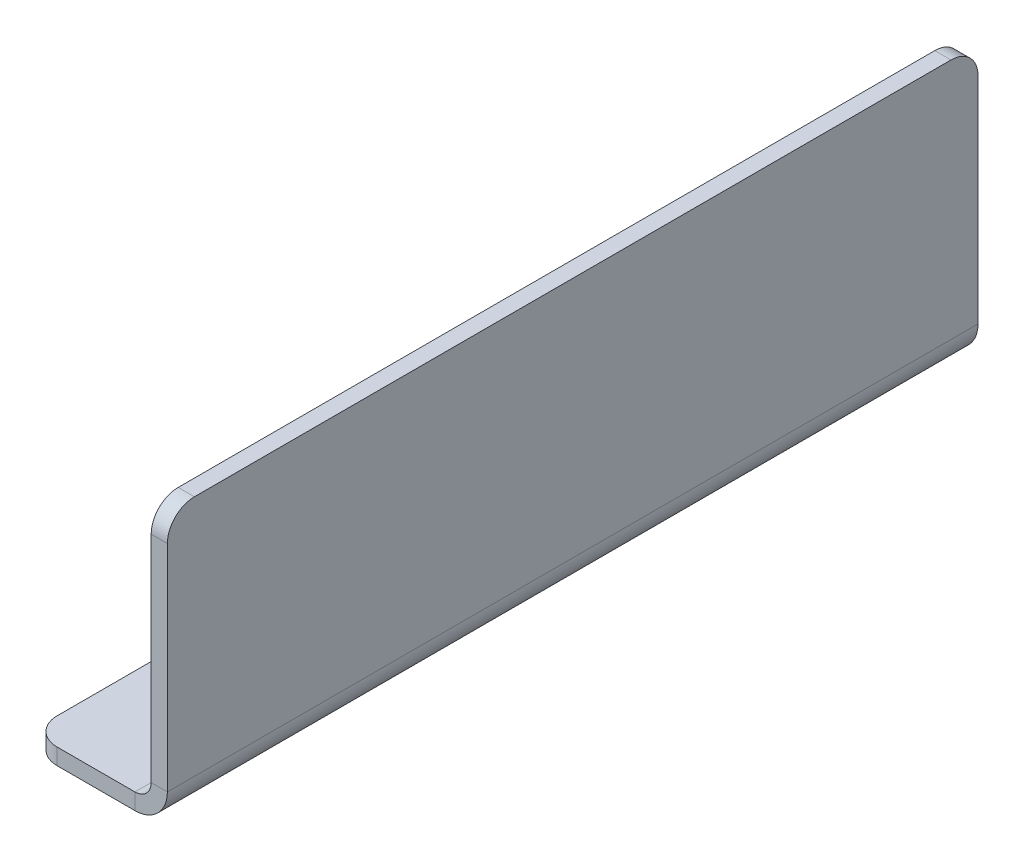
ISO-10303-21;
HEADER;
FILE_DESCRIPTION(('STEP AP214'),'2;1');
FILE_NAME('part.step','',(''),(''),'','','');
FILE_SCHEMA(('AUTOMOTIVE_DESIGN { 1 0 10303 214 1 1 1 1 }'));
ENDSEC;
DATA;
#1=APPLICATION_CONTEXT('core data for automotive mechanical design processes');
#2=APPLICATION_PROTOCOL_DEFINITION('international standard','automotive_design',2000,#1);
#3=PRODUCT_CONTEXT('',#1,'mechanical');
#4=PRODUCT('Part','Part','',(#3));
#5=PRODUCT_RELATED_PRODUCT_CATEGORY('part','',(#4));
#6=PRODUCT_DEFINITION_FORMATION('','',#4);
#7=PRODUCT_DEFINITION_CONTEXT('part definition',#1,'design');
#8=PRODUCT_DEFINITION('design','',#6,#7);
#9=PRODUCT_DEFINITION_SHAPE('','',#8);
#10=(LENGTH_UNIT() NAMED_UNIT(*) SI_UNIT(.MILLI.,.METRE.));
#11=(NAMED_UNIT(*) PLANE_ANGLE_UNIT() SI_UNIT($,.RADIAN.));
#12=(NAMED_UNIT(*) SI_UNIT($,.STERADIAN.) SOLID_ANGLE_UNIT());
#13=UNCERTAINTY_MEASURE_WITH_UNIT(LENGTH_MEASURE(1.E-05),#10,'distance_accuracy_value','');
#14=(GEOMETRIC_REPRESENTATION_CONTEXT(3) GLOBAL_UNCERTAINTY_ASSIGNED_CONTEXT((#13)) GLOBAL_UNIT_ASSIGNED_CONTEXT((#10,
#11,#12)) REPRESENTATION_CONTEXT('',''));
#15=CARTESIAN_POINT('',(0.,0.,0.));
#16=DIRECTION('',(0.,0.,1.));
#17=DIRECTION('',(1.,0.,0.));
#18=AXIS2_PLACEMENT_3D('',#15,#16,#17);
#19=CARTESIAN_POINT('',(-6.,0.,150.));
#20=DIRECTION('',(0.,0.,1.));
#21=DIRECTION('',(1.,0.,0.));
#22=AXIS2_PLACEMENT_3D('',#19,#20,#21);
#23=PLANE('',#22);
#24=DIRECTION('',(0.,1.,0.));
#25=VECTOR('',#24,1.);
#26=CARTESIAN_POINT('',(-6.,0.,150.));
#27=LINE('',#26,#25);
#28=CARTESIAN_POINT('',(-6.,0.,150.));
#29=VERTEX_POINT('',#28);
#30=CARTESIAN_POINT('',(-6.,3.,150.));
#31=VERTEX_POINT('',#30);
#32=EDGE_CURVE('E136',#29,#31,#27,.T.);
#33=ORIENTED_EDGE('',*,*,#32,.F.);
#34=CARTESIAN_POINT('',(-6.,6.,150.));
#35=DIRECTION('',(0.,0.,1.));
#36=DIRECTION('',(1.,0.,0.));
#37=AXIS2_PLACEMENT_3D('',#34,#35,#36);
#38=CIRCLE('',#37,6.);
#39=CARTESIAN_POINT('',(0.,6.,150.));
#40=VERTEX_POINT('',#39);
#41=EDGE_CURVE('E140',#40,#29,#38,.F.);
#42=ORIENTED_EDGE('',*,*,#41,.F.);
#43=DIRECTION('',(1.,0.,0.));
#44=VECTOR('',#43,1.);
#45=CARTESIAN_POINT('',(-3.,6.,150.));
#46=LINE('',#45,#44);
#47=CARTESIAN_POINT('',(-3.,6.,150.));
#48=VERTEX_POINT('',#47);
#49=EDGE_CURVE('E149',#48,#40,#46,.T.);
#50=ORIENTED_EDGE('',*,*,#49,.F.);
#51=CARTESIAN_POINT('',(-6.,6.,150.));
#52=DIRECTION('',(0.,0.,1.));
#53=DIRECTION('',(1.,0.,0.));
#54=AXIS2_PLACEMENT_3D('',#51,#52,#53);
#55=CIRCLE('',#54,3.);
#56=EDGE_CURVE('E142',#48,#31,#55,.F.);
#57=ORIENTED_EDGE('',*,*,#56,.T.);
#58=EDGE_LOOP('',(#33,#42,#50,#57));
#59=FACE_BOUND('',#58,.T.);
#60=ADVANCED_FACE('F45',(#59),#23,.T.);
#61=CARTESIAN_POINT('',(-3.,6.,150.));
#62=DIRECTION('',(0.,0.,1.));
#63=DIRECTION('',(1.,0.,0.));
#64=AXIS2_PLACEMENT_3D('',#61,#62,#63);
#65=PLANE('',#64);
#66=DIRECTION('',(-1.,0.,0.));
#67=VECTOR('',#66,1.);
#68=CARTESIAN_POINT('',(0.,3.,150.));
#69=LINE('',#68,#67);
#70=CARTESIAN_POINT('',(-20.4,3.,150.));
#71=VERTEX_POINT('',#70);
#72=EDGE_CURVE('E172',#31,#71,#69,.T.);
#73=ORIENTED_EDGE('',*,*,#72,.T.);
#74=DIRECTION('',(0.,1.,0.));
#75=VECTOR('',#74,1.);
#76=CARTESIAN_POINT('',(-20.4,6.,150.));
#77=LINE('',#76,#75);
#78=CARTESIAN_POINT('',(-20.4,0.,150.));
#79=VERTEX_POINT('',#78);
#80=EDGE_CURVE('E11',#71,#79,#77,.F.);
#81=ORIENTED_EDGE('',*,*,#80,.T.);
#82=DIRECTION('',(-1.,0.,0.));
#83=VECTOR('',#82,1.);
#84=CARTESIAN_POINT('',(0.,0.,150.));
#85=LINE('',#84,#83);
#86=EDGE_CURVE('E158',#29,#79,#85,.T.);
#87=ORIENTED_EDGE('',*,*,#86,.F.);
#88=ORIENTED_EDGE('',*,*,#32,.T.);
#89=EDGE_LOOP('',(#73,#81,#87,#88));
#90=FACE_BOUND('',#89,.T.);
#91=ADVANCED_FACE('F169',(#90),#65,.T.);
#92=CARTESIAN_POINT('',(0.,6.,0.));
#93=DIRECTION('',(0.,0.,-1.));
#94=DIRECTION('',(-1.,0.,0.));
#95=AXIS2_PLACEMENT_3D('',#92,#93,#94);
#96=PLANE('',#95);
#97=DIRECTION('',(-1.,0.,0.));
#98=VECTOR('',#97,1.);
#99=CARTESIAN_POINT('',(0.,6.,0.));
#100=LINE('',#99,#98);
#101=CARTESIAN_POINT('',(0.,6.,0.));
#102=VERTEX_POINT('',#101);
#103=CARTESIAN_POINT('',(-3.,6.,0.));
#104=VERTEX_POINT('',#103);
#105=EDGE_CURVE('E234',#102,#104,#100,.T.);
#106=ORIENTED_EDGE('',*,*,#105,.F.);
#107=CARTESIAN_POINT('',(-6.,6.,0.));
#108=DIRECTION('',(0.,0.,1.));
#109=DIRECTION('',(1.,0.,0.));
#110=AXIS2_PLACEMENT_3D('',#107,#108,#109);
#111=CIRCLE('',#110,6.);
#112=CARTESIAN_POINT('',(-6.,0.,0.));
#113=VERTEX_POINT('',#112);
#114=EDGE_CURVE('E197',#102,#113,#111,.F.);
#115=ORIENTED_EDGE('',*,*,#114,.T.);
#116=DIRECTION('',(0.,-1.,0.));
#117=VECTOR('',#116,1.);
#118=CARTESIAN_POINT('',(-6.,3.,0.));
#119=LINE('',#118,#117);
#120=CARTESIAN_POINT('',(-6.,3.,0.));
#121=VERTEX_POINT('',#120);
#122=EDGE_CURVE('E231',#121,#113,#119,.T.);
#123=ORIENTED_EDGE('',*,*,#122,.F.);
#124=CARTESIAN_POINT('',(-6.,6.,0.));
#125=DIRECTION('',(0.,0.,1.));
#126=DIRECTION('',(1.,0.,0.));
#127=AXIS2_PLACEMENT_3D('',#124,#125,#126);
#128=CIRCLE('',#127,3.);
#129=EDGE_CURVE('E206',#104,#121,#128,.F.);
#130=ORIENTED_EDGE('',*,*,#129,.F.);
#131=EDGE_LOOP('',(#106,#115,#123,#130));
#132=FACE_BOUND('',#131,.T.);
#133=ADVANCED_FACE('F371',(#132),#96,.T.);
#134=CARTESIAN_POINT('',(-6.,3.,0.));
#135=DIRECTION('',(0.,0.,-1.));
#136=DIRECTION('',(-1.,0.,0.));
#137=AXIS2_PLACEMENT_3D('',#134,#135,#136);
#138=PLANE('',#137);
#139=DIRECTION('',(0.,1.,0.));
#140=VECTOR('',#139,1.);
#141=CARTESIAN_POINT('',(-3.,0.,0.));
#142=LINE('',#141,#140);
#143=CARTESIAN_POINT('',(-3.,45.8,0.));
#144=VERTEX_POINT('',#143);
#145=EDGE_CURVE('E203',#144,#104,#142,.F.);
#146=ORIENTED_EDGE('',*,*,#145,.F.);
#147=DIRECTION('',(1.,0.,0.));
#148=VECTOR('',#147,1.);
#149=CARTESIAN_POINT('',(-6.,45.8,0.));
#150=LINE('',#149,#148);
#151=CARTESIAN_POINT('',(0.,45.8,0.));
#152=VERTEX_POINT('',#151);
#153=EDGE_CURVE('E263',#144,#152,#150,.T.);
#154=ORIENTED_EDGE('',*,*,#153,.T.);
#155=DIRECTION('',(0.,-1.,0.));
#156=VECTOR('',#155,1.);
#157=CARTESIAN_POINT('',(0.,0.,0.));
#158=LINE('',#157,#156);
#159=EDGE_CURVE('E200',#152,#102,#158,.T.);
#160=ORIENTED_EDGE('',*,*,#159,.T.);
#161=ORIENTED_EDGE('',*,*,#105,.T.);
#162=EDGE_LOOP('',(#146,#154,#160,#161));
#163=FACE_BOUND('',#162,.T.);
#164=ADVANCED_FACE('F293',(#163),#138,.T.);
#165=CARTESIAN_POINT('',(0.,3.,150.));
#166=DIRECTION('',(0.,-1.,0.));
#167=DIRECTION('',(1.,0.,0.));
#168=AXIS2_PLACEMENT_3D('',#165,#166,#167);
#169=PLANE('',#168);
#170=CARTESIAN_POINT('',(-15.7,3.,25.));
#171=DIRECTION('',(0.,1.,0.));
#172=DIRECTION('',(0.,0.,1.));
#173=AXIS2_PLACEMENT_3D('',#170,#171,#172);
#174=CIRCLE('',#173,1.63194999999999);
#175=CARTESIAN_POINT('',(-15.7,3.,26.63195));
#176=VERTEX_POINT('',#175);
#177=EDGE_CURVE('E335',#176,#176,#174,.T.);
#178=ORIENTED_EDGE('',*,*,#177,.F.);
#179=EDGE_LOOP('',(#178));
#180=FACE_BOUND('',#179,.T.);
#181=CARTESIAN_POINT('',(-15.7,3.,75.));
#182=DIRECTION('',(0.,1.,0.));
#183=DIRECTION('',(0.,0.,1.));
#184=AXIS2_PLACEMENT_3D('',#181,#182,#183);
#185=CIRCLE('',#184,1.63194999999999);
#186=CARTESIAN_POINT('',(-15.7,3.,76.63195));
#187=VERTEX_POINT('',#186);
#188=EDGE_CURVE('E327',#187,#187,#185,.T.);
#189=ORIENTED_EDGE('',*,*,#188,.F.);
#190=EDGE_LOOP('',(#189));
#191=FACE_BOUND('',#190,.T.);
#192=CARTESIAN_POINT('',(-15.7,3.,125.));
#193=DIRECTION('',(0.,1.,0.));
#194=DIRECTION('',(0.,0.,1.));
#195=AXIS2_PLACEMENT_3D('',#192,#193,#194);
#196=CIRCLE('',#195,1.63194999999999);
#197=CARTESIAN_POINT('',(-15.7,3.,126.63195));
#198=VERTEX_POINT('',#197);
#199=EDGE_CURVE('E319',#198,#198,#196,.T.);
#200=ORIENTED_EDGE('',*,*,#199,.F.);
#201=EDGE_LOOP('',(#200));
#202=FACE_BOUND('',#201,.T.);
#203=DIRECTION('',(-1.,0.,0.));
#204=VECTOR('',#203,1.);
#205=CARTESIAN_POINT('',(0.,3.,0.));
#206=LINE('',#205,#204);
#207=CARTESIAN_POINT('',(-20.4,3.,0.));
#208=VERTEX_POINT('',#207);
#209=EDGE_CURVE('E190',#121,#208,#206,.T.);
#210=ORIENTED_EDGE('',*,*,#209,.T.);
#211=CARTESIAN_POINT('',(-20.4,3.,5.));
#212=DIRECTION('',(0.,-1.,0.));
#213=DIRECTION('',(1.,0.,0.));
#214=AXIS2_PLACEMENT_3D('',#211,#212,#213);
#215=CIRCLE('',#214,5.);
#216=CARTESIAN_POINT('',(-25.4,3.,5.));
#217=VERTEX_POINT('',#216);
#218=EDGE_CURVE('E247',#208,#217,#215,.F.);
#219=ORIENTED_EDGE('',*,*,#218,.T.);
#220=DIRECTION('',(0.,0.,-1.));
#221=VECTOR('',#220,1.);
#222=CARTESIAN_POINT('',(-25.4,3.,150.));
#223=LINE('',#222,#221);
#224=CARTESIAN_POINT('',(-25.4,3.,145.));
#225=VERTEX_POINT('',#224);
#226=EDGE_CURVE('E227',#225,#217,#223,.T.);
#227=ORIENTED_EDGE('',*,*,#226,.F.);
#228=CARTESIAN_POINT('',(-20.4,3.,145.));
#229=DIRECTION('',(0.,-1.,0.));
#230=DIRECTION('',(1.,0.,0.));
#231=AXIS2_PLACEMENT_3D('',#228,#229,#230);
#232=CIRCLE('',#231,5.);
#233=EDGE_CURVE('E244',#225,#71,#232,.F.);
#234=ORIENTED_EDGE('',*,*,#233,.T.);
#235=ORIENTED_EDGE('',*,*,#72,.F.);
#236=DIRECTION('',(0.,0.,-1.));
#237=VECTOR('',#236,1.);
#238=CARTESIAN_POINT('',(-6.,3.,150.));
#239=LINE('',#238,#237);
#240=EDGE_CURVE('E189',#31,#121,#239,.T.);
#241=ORIENTED_EDGE('',*,*,#240,.T.);
#242=EDGE_LOOP('',(#210,#219,#227,#234,#235,#241));
#243=FACE_BOUND('',#242,.T.);
#244=ADVANCED_FACE('F312',(#180,#191,#202,#243),#169,.F.);
#245=CARTESIAN_POINT('',(-25.4,0.,150.));
#246=DIRECTION('',(-1.,0.,0.));
#247=DIRECTION('',(0.,0.,1.));
#248=AXIS2_PLACEMENT_3D('',#245,#246,#247);
#249=PLANE('',#248);
#250=ORIENTED_EDGE('',*,*,#226,.T.);
#251=DIRECTION('',(0.,1.,0.));
#252=VECTOR('',#251,1.);
#253=CARTESIAN_POINT('',(-25.4,0.,5.));
#254=LINE('',#253,#252);
#255=CARTESIAN_POINT('',(-25.4,0.,5.));
#256=VERTEX_POINT('',#255);
#257=EDGE_CURVE('E254',#217,#256,#254,.F.);
#258=ORIENTED_EDGE('',*,*,#257,.T.);
#259=DIRECTION('',(0.,0.,-1.));
#260=VECTOR('',#259,1.);
#261=CARTESIAN_POINT('',(-25.4,0.,150.));
#262=LINE('',#261,#260);
#263=CARTESIAN_POINT('',(-25.4,0.,145.));
#264=VERTEX_POINT('',#263);
#265=EDGE_CURVE('E166',#264,#256,#262,.T.);
#266=ORIENTED_EDGE('',*,*,#265,.F.);
#267=DIRECTION('',(0.,1.,0.));
#268=VECTOR('',#267,1.);
#269=CARTESIAN_POINT('',(-25.4,0.,145.));
#270=LINE('',#269,#268);
#271=EDGE_CURVE('E250',#264,#225,#270,.T.);
#272=ORIENTED_EDGE('',*,*,#271,.T.);
#273=EDGE_LOOP('',(#250,#258,#266,#272));
#274=FACE_BOUND('',#273,.T.);
#275=ADVANCED_FACE('F344',(#274),#249,.T.);
#276=CARTESIAN_POINT('',(0.,0.,150.));
#277=DIRECTION('',(0.,-1.,0.));
#278=DIRECTION('',(1.,0.,0.));
#279=AXIS2_PLACEMENT_3D('',#276,#277,#278);
#280=PLANE('',#279);
#281=CARTESIAN_POINT('',(-15.7,0.,25.));
#282=DIRECTION('',(0.,1.,0.));
#283=DIRECTION('',(0.,0.,1.));
#284=AXIS2_PLACEMENT_3D('',#281,#282,#283);
#285=CIRCLE('',#284,1.63195);
#286=CARTESIAN_POINT('',(-15.7,0.,26.63195));
#287=VERTEX_POINT('',#286);
#288=EDGE_CURVE('E331',#287,#287,#285,.T.);
#289=ORIENTED_EDGE('',*,*,#288,.T.);
#290=EDGE_LOOP('',(#289));
#291=FACE_BOUND('',#290,.T.);
#292=CARTESIAN_POINT('',(-15.7,0.,75.));
#293=DIRECTION('',(0.,1.,0.));
#294=DIRECTION('',(0.,0.,1.));
#295=AXIS2_PLACEMENT_3D('',#292,#293,#294);
#296=CIRCLE('',#295,1.63195);
#297=CARTESIAN_POINT('',(-15.7,0.,76.63195));
#298=VERTEX_POINT('',#297);
#299=EDGE_CURVE('E323',#298,#298,#296,.T.);
#300=ORIENTED_EDGE('',*,*,#299,.T.);
#301=EDGE_LOOP('',(#300));
#302=FACE_BOUND('',#301,.T.);
#303=CARTESIAN_POINT('',(-15.7,0.,125.));
#304=DIRECTION('',(0.,1.,0.));
#305=DIRECTION('',(0.,0.,1.));
#306=AXIS2_PLACEMENT_3D('',#303,#304,#305);
#307=CIRCLE('',#306,1.63195);
#308=CARTESIAN_POINT('',(-15.7,0.,126.63195));
#309=VERTEX_POINT('',#308);
#310=EDGE_CURVE('E194',#309,#309,#307,.T.);
#311=ORIENTED_EDGE('',*,*,#310,.T.);
#312=EDGE_LOOP('',(#311));
#313=FACE_BOUND('',#312,.T.);
#314=ORIENTED_EDGE('',*,*,#265,.T.);
#315=CARTESIAN_POINT('',(-20.4,0.,5.));
#316=DIRECTION('',(0.,-1.,0.));
#317=DIRECTION('',(1.,0.,0.));
#318=AXIS2_PLACEMENT_3D('',#315,#316,#317);
#319=CIRCLE('',#318,5.);
#320=CARTESIAN_POINT('',(-20.4,0.,0.));
#321=VERTEX_POINT('',#320);
#322=EDGE_CURVE('E260',#256,#321,#319,.T.);
#323=ORIENTED_EDGE('',*,*,#322,.T.);
#324=DIRECTION('',(-1.,0.,0.));
#325=VECTOR('',#324,1.);
#326=CARTESIAN_POINT('',(0.,0.,0.));
#327=LINE('',#326,#325);
#328=EDGE_CURVE('E161',#113,#321,#327,.T.);
#329=ORIENTED_EDGE('',*,*,#328,.F.);
#330=DIRECTION('',(0.,0.,-1.));
#331=VECTOR('',#330,1.);
#332=CARTESIAN_POINT('',(-6.,0.,150.));
#333=LINE('',#332,#331);
#334=EDGE_CURVE('E155',#29,#113,#333,.T.);
#335=ORIENTED_EDGE('',*,*,#334,.F.);
#336=ORIENTED_EDGE('',*,*,#86,.T.);
#337=CARTESIAN_POINT('',(-20.4,0.,145.));
#338=DIRECTION('',(0.,-1.,0.));
#339=DIRECTION('',(1.,0.,0.));
#340=AXIS2_PLACEMENT_3D('',#337,#338,#339);
#341=CIRCLE('',#340,5.);
#342=EDGE_CURVE('E257',#79,#264,#341,.T.);
#343=ORIENTED_EDGE('',*,*,#342,.T.);
#344=EDGE_LOOP('',(#314,#323,#329,#335,#336,#343));
#345=FACE_BOUND('',#344,.T.);
#346=ADVANCED_FACE('F157',(#291,#302,#313,#345),#280,.T.);
#347=CARTESIAN_POINT('',(-6.,6.,150.));
#348=DIRECTION('',(0.,0.,-1.));
#349=DIRECTION('',(-1.,0.,0.));
#350=AXIS2_PLACEMENT_3D('',#347,#348,#349);
#351=CYLINDRICAL_SURFACE('',#350,6.);
#352=ORIENTED_EDGE('',*,*,#114,.F.);
#353=DIRECTION('',(0.,0.,-1.));
#354=VECTOR('',#353,1.);
#355=CARTESIAN_POINT('',(0.,6.,150.));
#356=LINE('',#355,#354);
#357=EDGE_CURVE('E167',#40,#102,#356,.T.);
#358=ORIENTED_EDGE('',*,*,#357,.F.);
#359=ORIENTED_EDGE('',*,*,#41,.T.);
#360=ORIENTED_EDGE('',*,*,#334,.T.);
#361=EDGE_LOOP('',(#352,#358,#359,#360));
#362=FACE_BOUND('',#361,.T.);
#363=ADVANCED_FACE('F175',(#362),#351,.T.);
#364=CARTESIAN_POINT('',(0.,0.,150.));
#365=DIRECTION('',(1.,0.,0.));
#366=DIRECTION('',(0.,0.,-1.));
#367=AXIS2_PLACEMENT_3D('',#364,#365,#366);
#368=PLANE('',#367);
#369=ORIENTED_EDGE('',*,*,#159,.F.);
#370=CARTESIAN_POINT('',(0.,45.8,5.));
#371=DIRECTION('',(1.,0.,0.));
#372=DIRECTION('',(0.,0.,-1.));
#373=AXIS2_PLACEMENT_3D('',#370,#371,#372);
#374=CIRCLE('',#373,5.);
#375=CARTESIAN_POINT('',(0.,50.8,5.));
#376=VERTEX_POINT('',#375);
#377=EDGE_CURVE('E270',#152,#376,#374,.T.);
#378=ORIENTED_EDGE('',*,*,#377,.T.);
#379=DIRECTION('',(0.,0.,-1.));
#380=VECTOR('',#379,1.);
#381=CARTESIAN_POINT('',(0.,50.8,150.));
#382=LINE('',#381,#380);
#383=CARTESIAN_POINT('',(0.,50.8,145.));
#384=VERTEX_POINT('',#383);
#385=EDGE_CURVE('E220',#384,#376,#382,.T.);
#386=ORIENTED_EDGE('',*,*,#385,.F.);
#387=CARTESIAN_POINT('',(0.,45.8,145.));
#388=DIRECTION('',(1.,0.,0.));
#389=DIRECTION('',(0.,0.,-1.));
#390=AXIS2_PLACEMENT_3D('',#387,#388,#389);
#391=CIRCLE('',#390,5.);
#392=CARTESIAN_POINT('',(0.,45.8,150.));
#393=VERTEX_POINT('',#392);
#394=EDGE_CURVE('E267',#384,#393,#391,.T.);
#395=ORIENTED_EDGE('',*,*,#394,.T.);
#396=DIRECTION('',(0.,-1.,0.));
#397=VECTOR('',#396,1.);
#398=CARTESIAN_POINT('',(0.,0.,150.));
#399=LINE('',#398,#397);
#400=EDGE_CURVE('E178',#393,#40,#399,.T.);
#401=ORIENTED_EDGE('',*,*,#400,.T.);
#402=ORIENTED_EDGE('',*,*,#357,.T.);
#403=EDGE_LOOP('',(#369,#378,#386,#395,#401,#402));
#404=FACE_BOUND('',#403,.T.);
#405=ADVANCED_FACE('F299',(#404),#368,.T.);
#406=CARTESIAN_POINT('',(-3.,50.8,150.));
#407=DIRECTION('',(0.,1.,0.));
#408=DIRECTION('',(0.,0.,1.));
#409=AXIS2_PLACEMENT_3D('',#406,#407,#408);
#410=PLANE('',#409);
#411=ORIENTED_EDGE('',*,*,#385,.T.);
#412=DIRECTION('',(1.,0.,0.));
#413=VECTOR('',#412,1.);
#414=CARTESIAN_POINT('',(-3.,50.8,5.));
#415=LINE('',#414,#413);
#416=CARTESIAN_POINT('',(-3.,50.8,5.));
#417=VERTEX_POINT('',#416);
#418=EDGE_CURVE('E68',#376,#417,#415,.F.);
#419=ORIENTED_EDGE('',*,*,#418,.T.);
#420=DIRECTION('',(0.,0.,-1.));
#421=VECTOR('',#420,1.);
#422=CARTESIAN_POINT('',(-3.,50.8,150.));
#423=LINE('',#422,#421);
#424=CARTESIAN_POINT('',(-3.,50.8,145.));
#425=VERTEX_POINT('',#424);
#426=EDGE_CURVE('E217',#425,#417,#423,.T.);
#427=ORIENTED_EDGE('',*,*,#426,.F.);
#428=DIRECTION('',(1.,0.,0.));
#429=VECTOR('',#428,1.);
#430=CARTESIAN_POINT('',(-3.,50.8,145.));
#431=LINE('',#430,#429);
#432=EDGE_CURVE('E273',#425,#384,#431,.T.);
#433=ORIENTED_EDGE('',*,*,#432,.T.);
#434=EDGE_LOOP('',(#411,#419,#427,#433));
#435=FACE_BOUND('',#434,.T.);
#436=ADVANCED_FACE('F300',(#435),#410,.T.);
#437=CARTESIAN_POINT('',(-3.,0.,150.));
#438=DIRECTION('',(1.,0.,0.));
#439=DIRECTION('',(0.,0.,-1.));
#440=AXIS2_PLACEMENT_3D('',#437,#438,#439);
#441=PLANE('',#440);
#442=ORIENTED_EDGE('',*,*,#426,.T.);
#443=CARTESIAN_POINT('',(-3.,45.8,5.));
#444=DIRECTION('',(1.,0.,0.));
#445=DIRECTION('',(0.,0.,-1.));
#446=AXIS2_PLACEMENT_3D('',#443,#444,#445);
#447=CIRCLE('',#446,5.);
#448=EDGE_CURVE('E282',#417,#144,#447,.F.);
#449=ORIENTED_EDGE('',*,*,#448,.T.);
#450=ORIENTED_EDGE('',*,*,#145,.T.);
#451=DIRECTION('',(0.,0.,-1.));
#452=VECTOR('',#451,1.);
#453=CARTESIAN_POINT('',(-3.,6.,150.));
#454=LINE('',#453,#452);
#455=EDGE_CURVE('E213',#48,#104,#454,.T.);
#456=ORIENTED_EDGE('',*,*,#455,.F.);
#457=DIRECTION('',(0.,1.,0.));
#458=VECTOR('',#457,1.);
#459=CARTESIAN_POINT('',(-3.,0.,150.));
#460=LINE('',#459,#458);
#461=CARTESIAN_POINT('',(-3.,45.8,150.));
#462=VERTEX_POINT('',#461);
#463=EDGE_CURVE('E181',#462,#48,#460,.F.);
#464=ORIENTED_EDGE('',*,*,#463,.F.);
#465=CARTESIAN_POINT('',(-3.,45.8,145.));
#466=DIRECTION('',(1.,0.,0.));
#467=DIRECTION('',(0.,0.,-1.));
#468=AXIS2_PLACEMENT_3D('',#465,#466,#467);
#469=CIRCLE('',#468,5.);
#470=EDGE_CURVE('E279',#462,#425,#469,.F.);
#471=ORIENTED_EDGE('',*,*,#470,.T.);
#472=EDGE_LOOP('',(#442,#449,#450,#456,#464,#471));
#473=FACE_BOUND('',#472,.T.);
#474=ADVANCED_FACE('F288',(#473),#441,.F.);
#475=CARTESIAN_POINT('',(-6.,6.,150.));
#476=DIRECTION('',(0.,0.,-1.));
#477=DIRECTION('',(-1.,0.,0.));
#478=AXIS2_PLACEMENT_3D('',#475,#476,#477);
#479=CYLINDRICAL_SURFACE('',#478,3.);
#480=ORIENTED_EDGE('',*,*,#129,.T.);
#481=ORIENTED_EDGE('',*,*,#240,.F.);
#482=ORIENTED_EDGE('',*,*,#56,.F.);
#483=ORIENTED_EDGE('',*,*,#455,.T.);
#484=EDGE_LOOP('',(#480,#481,#482,#483));
#485=FACE_BOUND('',#484,.T.);
#486=ADVANCED_FACE('F308',(#485),#479,.F.);
#487=CARTESIAN_POINT('',(-6.,6.,150.));
#488=DIRECTION('',(0.,0.,1.));
#489=DIRECTION('',(1.,0.,0.));
#490=AXIS2_PLACEMENT_3D('',#487,#488,#489);
#491=PLANE('',#490);
#492=ORIENTED_EDGE('',*,*,#400,.F.);
#493=DIRECTION('',(1.,0.,0.));
#494=VECTOR('',#493,1.);
#495=CARTESIAN_POINT('',(-6.,45.8,150.));
#496=LINE('',#495,#494);
#497=EDGE_CURVE('E54',#393,#462,#496,.F.);
#498=ORIENTED_EDGE('',*,*,#497,.T.);
#499=ORIENTED_EDGE('',*,*,#463,.T.);
#500=ORIENTED_EDGE('',*,*,#49,.T.);
#501=EDGE_LOOP('',(#492,#498,#499,#500));
#502=FACE_BOUND('',#501,.T.);
#503=ADVANCED_FACE('F305',(#502),#491,.T.);
#504=CARTESIAN_POINT('',(-6.,6.,0.));
#505=DIRECTION('',(0.,0.,1.));
#506=DIRECTION('',(1.,0.,0.));
#507=AXIS2_PLACEMENT_3D('',#504,#505,#506);
#508=PLANE('',#507);
#509=ORIENTED_EDGE('',*,*,#328,.T.);
#510=DIRECTION('',(0.,1.,0.));
#511=VECTOR('',#510,1.);
#512=CARTESIAN_POINT('',(-20.4,3.,0.));
#513=LINE('',#512,#511);
#514=EDGE_CURVE('E148',#321,#208,#513,.T.);
#515=ORIENTED_EDGE('',*,*,#514,.T.);
#516=ORIENTED_EDGE('',*,*,#209,.F.);
#517=ORIENTED_EDGE('',*,*,#122,.T.);
#518=EDGE_LOOP('',(#509,#515,#516,#517));
#519=FACE_BOUND('',#518,.T.);
#520=ADVANCED_FACE('F353',(#519),#508,.F.);
#521=CARTESIAN_POINT('',(-15.7,3.,125.));
#522=DIRECTION('',(0.,1.,0.));
#523=DIRECTION('',(0.,0.,1.));
#524=AXIS2_PLACEMENT_3D('',#521,#522,#523);
#525=CYLINDRICAL_SURFACE('',#524,1.63194999999999);
#526=ORIENTED_EDGE('',*,*,#310,.F.);
#527=EDGE_LOOP('',(#526));
#528=FACE_BOUND('',#527,.T.);
#529=ORIENTED_EDGE('',*,*,#199,.T.);
#530=EDGE_LOOP('',(#529));
#531=FACE_BOUND('',#530,.T.);
#532=ADVANCED_FACE('F350',(#528,#531),#525,.F.);
#533=CARTESIAN_POINT('',(-15.7,3.,75.));
#534=DIRECTION('',(0.,1.,0.));
#535=DIRECTION('',(0.,0.,1.));
#536=AXIS2_PLACEMENT_3D('',#533,#534,#535);
#537=CYLINDRICAL_SURFACE('',#536,1.63194999999999);
#538=ORIENTED_EDGE('',*,*,#299,.F.);
#539=EDGE_LOOP('',(#538));
#540=FACE_BOUND('',#539,.T.);
#541=ORIENTED_EDGE('',*,*,#188,.T.);
#542=EDGE_LOOP('',(#541));
#543=FACE_BOUND('',#542,.T.);
#544=ADVANCED_FACE('F352',(#540,#543),#537,.F.);
#545=CARTESIAN_POINT('',(-15.7,3.,25.));
#546=DIRECTION('',(0.,1.,0.));
#547=DIRECTION('',(0.,0.,1.));
#548=AXIS2_PLACEMENT_3D('',#545,#546,#547);
#549=CYLINDRICAL_SURFACE('',#548,1.63194999999999);
#550=ORIENTED_EDGE('',*,*,#288,.F.);
#551=EDGE_LOOP('',(#550));
#552=FACE_BOUND('',#551,.T.);
#553=ORIENTED_EDGE('',*,*,#177,.T.);
#554=EDGE_LOOP('',(#553));
#555=FACE_BOUND('',#554,.T.);
#556=ADVANCED_FACE('F340',(#552,#555),#549,.F.);
#557=CARTESIAN_POINT('',(-20.4,6.,5.));
#558=DIRECTION('',(0.,-1.,0.));
#559=DIRECTION('',(0.,0.,-1.));
#560=AXIS2_PLACEMENT_3D('',#557,#558,#559);
#561=CYLINDRICAL_SURFACE('',#560,5.);
#562=ORIENTED_EDGE('',*,*,#322,.F.);
#563=ORIENTED_EDGE('',*,*,#257,.F.);
#564=ORIENTED_EDGE('',*,*,#218,.F.);
#565=ORIENTED_EDGE('',*,*,#514,.F.);
#566=EDGE_LOOP('',(#562,#563,#564,#565));
#567=FACE_BOUND('',#566,.T.);
#568=ADVANCED_FACE('F375',(#567),#561,.T.);
#569=CARTESIAN_POINT('',(-6.,45.8,5.));
#570=DIRECTION('',(1.,0.,0.));
#571=DIRECTION('',(0.,0.,-1.));
#572=AXIS2_PLACEMENT_3D('',#569,#570,#571);
#573=CYLINDRICAL_SURFACE('',#572,5.);
#574=ORIENTED_EDGE('',*,*,#448,.F.);
#575=ORIENTED_EDGE('',*,*,#418,.F.);
#576=ORIENTED_EDGE('',*,*,#377,.F.);
#577=ORIENTED_EDGE('',*,*,#153,.F.);
#578=EDGE_LOOP('',(#574,#575,#576,#577));
#579=FACE_BOUND('',#578,.T.);
#580=ADVANCED_FACE('F296',(#579),#573,.T.);
#581=CARTESIAN_POINT('',(-3.,45.8,145.));
#582=DIRECTION('',(1.,0.,0.));
#583=DIRECTION('',(0.,0.,-1.));
#584=AXIS2_PLACEMENT_3D('',#581,#582,#583);
#585=CYLINDRICAL_SURFACE('',#584,5.);
#586=ORIENTED_EDGE('',*,*,#470,.F.);
#587=ORIENTED_EDGE('',*,*,#497,.F.);
#588=ORIENTED_EDGE('',*,*,#394,.F.);
#589=ORIENTED_EDGE('',*,*,#432,.F.);
#590=EDGE_LOOP('',(#586,#587,#588,#589));
#591=FACE_BOUND('',#590,.T.);
#592=ADVANCED_FACE('F304',(#591),#585,.T.);
#593=CARTESIAN_POINT('',(-20.4,0.,145.));
#594=DIRECTION('',(0.,1.,0.));
#595=DIRECTION('',(0.,0.,1.));
#596=AXIS2_PLACEMENT_3D('',#593,#594,#595);
#597=CYLINDRICAL_SURFACE('',#596,5.);
#598=ORIENTED_EDGE('',*,*,#342,.F.);
#599=ORIENTED_EDGE('',*,*,#80,.F.);
#600=ORIENTED_EDGE('',*,*,#233,.F.);
#601=ORIENTED_EDGE('',*,*,#271,.F.);
#602=EDGE_LOOP('',(#598,#599,#600,#601));
#603=FACE_BOUND('',#602,.T.);
#604=ADVANCED_FACE('F47',(#603),#597,.T.);
#605=CLOSED_SHELL('',(#60,#91,#133,#164,#244,#275,#346,#363,#405,#436,#474,#486,#503,#520,#532,
#544,#556,#568,#580,#592,#604));
#606=MANIFOLD_SOLID_BREP('B2',#605);
#607=ADVANCED_BREP_SHAPE_REPRESENTATION('',(#18,#606),#14);
#608=SHAPE_DEFINITION_REPRESENTATION(#9,#607);
ENDSEC;
END-ISO-10303-21;
